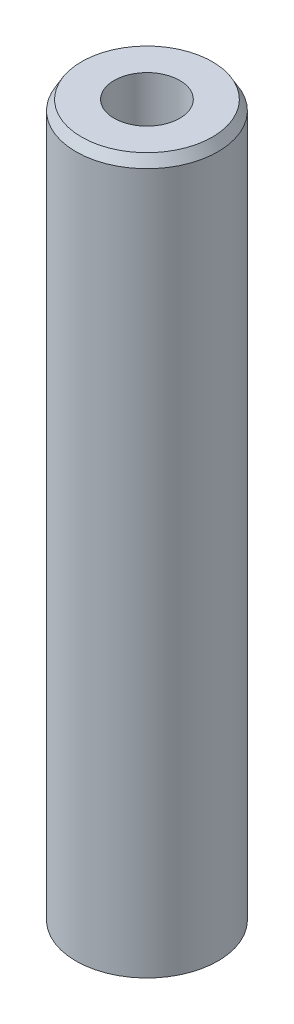
ISO-10303-21;
HEADER;
FILE_DESCRIPTION(('STEP AP214'),'2;1');
FILE_NAME('part.step','',(''),(''),'','','');
FILE_SCHEMA(('AUTOMOTIVE_DESIGN { 1 0 10303 214 1 1 1 1 }'));
ENDSEC;
DATA;
#1=APPLICATION_CONTEXT('core data for automotive mechanical design processes');
#2=APPLICATION_PROTOCOL_DEFINITION('international standard','automotive_design',2000,#1);
#3=PRODUCT_CONTEXT('',#1,'mechanical');
#4=PRODUCT('Part','Part','',(#3));
#5=PRODUCT_RELATED_PRODUCT_CATEGORY('part','',(#4));
#6=PRODUCT_DEFINITION_FORMATION('','',#4);
#7=PRODUCT_DEFINITION_CONTEXT('part definition',#1,'design');
#8=PRODUCT_DEFINITION('design','',#6,#7);
#9=PRODUCT_DEFINITION_SHAPE('','',#8);
#10=(LENGTH_UNIT() NAMED_UNIT(*) SI_UNIT(.MILLI.,.METRE.));
#11=(NAMED_UNIT(*) PLANE_ANGLE_UNIT() SI_UNIT($,.RADIAN.));
#12=(NAMED_UNIT(*) SI_UNIT($,.STERADIAN.) SOLID_ANGLE_UNIT());
#13=UNCERTAINTY_MEASURE_WITH_UNIT(LENGTH_MEASURE(1.E-05),#10,'distance_accuracy_value','');
#14=(GEOMETRIC_REPRESENTATION_CONTEXT(3) GLOBAL_UNCERTAINTY_ASSIGNED_CONTEXT((#13)) GLOBAL_UNIT_ASSIGNED_CONTEXT((#10,
#11,#12)) REPRESENTATION_CONTEXT('',''));
#15=CARTESIAN_POINT('',(0.,0.,0.));
#16=DIRECTION('',(0.,0.,1.));
#17=DIRECTION('',(1.,0.,0.));
#18=AXIS2_PLACEMENT_3D('',#15,#16,#17);
#19=CARTESIAN_POINT('',(0.,126.050752585523,0.));
#20=DIRECTION('',(0.,-1.,0.));
#21=DIRECTION('',(0.,0.,-1.));
#22=AXIS2_PLACEMENT_3D('',#19,#20,#21);
#23=CYLINDRICAL_SURFACE('',#22,12.5);
#24=CARTESIAN_POINT('',(0.,124.318361908282,0.));
#25=DIRECTION('',(0.,1.,0.));
#26=DIRECTION('',(0.,0.,1.));
#27=AXIS2_PLACEMENT_3D('',#24,#25,#26);
#28=CIRCLE('',#27,12.5);
#29=CARTESIAN_POINT('',(0.,124.318361908282,12.5));
#30=VERTEX_POINT('',#29);
#31=EDGE_CURVE('E50',#30,#30,#28,.F.);
#32=ORIENTED_EDGE('',*,*,#31,.T.);
#33=EDGE_LOOP('',(#32));
#34=FACE_BOUND('',#33,.T.);
#35=CARTESIAN_POINT('',(0.,1.00019622384667,0.));
#36=DIRECTION('',(0.,1.,0.));
#37=DIRECTION('',(0.,0.,1.));
#38=AXIS2_PLACEMENT_3D('',#35,#36,#37);
#39=CIRCLE('',#38,12.5);
#40=CARTESIAN_POINT('',(0.,1.00019622384667,12.5));
#41=VERTEX_POINT('',#40);
#42=EDGE_CURVE('E51',#41,#41,#39,.T.);
#43=ORIENTED_EDGE('',*,*,#42,.T.);
#44=EDGE_LOOP('',(#43));
#45=FACE_BOUND('',#44,.T.);
#46=ADVANCED_FACE('F39',(#34,#45),#23,.T.);
#47=CARTESIAN_POINT('',(0.,126.050752585523,0.));
#48=DIRECTION('',(0.,1.,0.));
#49=DIRECTION('',(0.,0.,1.));
#50=AXIS2_PLACEMENT_3D('',#47,#48,#49);
#51=PLANE('',#50);
#52=CARTESIAN_POINT('',(0.,126.050752585523,0.));
#53=DIRECTION('',(0.,1.,0.));
#54=DIRECTION('',(0.,0.,1.));
#55=AXIS2_PLACEMENT_3D('',#52,#53,#54);
#56=CIRCLE('',#55,11.4998037761534);
#57=CARTESIAN_POINT('',(0.,126.050752585523,11.4998037761534));
#58=VERTEX_POINT('',#57);
#59=EDGE_CURVE('E54',#58,#58,#56,.T.);
#60=ORIENTED_EDGE('',*,*,#59,.T.);
#61=EDGE_LOOP('',(#60));
#62=FACE_BOUND('',#61,.T.);
#63=CARTESIAN_POINT('',(0.,126.050752585523,0.));
#64=DIRECTION('',(0.,1.,0.));
#65=DIRECTION('',(0.,0.,1.));
#66=AXIS2_PLACEMENT_3D('',#63,#64,#65);
#67=CIRCLE('',#66,5.77568606063113);
#68=CARTESIAN_POINT('',(0.,126.050752585523,5.77568606063113));
#69=VERTEX_POINT('',#68);
#70=EDGE_CURVE('E58',#69,#69,#67,.T.);
#71=ORIENTED_EDGE('',*,*,#70,.F.);
#72=EDGE_LOOP('',(#71));
#73=FACE_BOUND('',#72,.T.);
#74=ADVANCED_FACE('F69',(#62,#73),#51,.T.);
#75=CARTESIAN_POINT('',(0.,0.,0.));
#76=DIRECTION('',(0.,1.,0.));
#77=DIRECTION('',(0.,0.,1.));
#78=AXIS2_PLACEMENT_3D('',#75,#76,#77);
#79=PLANE('',#78);
#80=CARTESIAN_POINT('',(0.,0.,0.));
#81=DIRECTION('',(0.,1.,0.));
#82=DIRECTION('',(0.,0.,1.));
#83=AXIS2_PLACEMENT_3D('',#80,#81,#82);
#84=CIRCLE('',#83,10.767609322759);
#85=CARTESIAN_POINT('',(0.,0.,10.767609322759));
#86=VERTEX_POINT('',#85);
#87=EDGE_CURVE('E10',#86,#86,#84,.F.);
#88=ORIENTED_EDGE('',*,*,#87,.T.);
#89=EDGE_LOOP('',(#88));
#90=FACE_BOUND('',#89,.T.);
#91=CARTESIAN_POINT('',(0.,0.,0.));
#92=DIRECTION('',(0.,1.,0.));
#93=DIRECTION('',(0.,0.,1.));
#94=AXIS2_PLACEMENT_3D('',#91,#92,#93);
#95=CIRCLE('',#94,5.77568606063113);
#96=CARTESIAN_POINT('',(0.,0.,5.77568606063113));
#97=VERTEX_POINT('',#96);
#98=EDGE_CURVE('E63',#97,#97,#95,.T.);
#99=ORIENTED_EDGE('',*,*,#98,.T.);
#100=EDGE_LOOP('',(#99));
#101=FACE_BOUND('',#100,.T.);
#102=ADVANCED_FACE('F75',(#90,#101),#79,.F.);
#103=CARTESIAN_POINT('',(0.,126.050752585523,0.));
#104=DIRECTION('',(0.,-1.,0.));
#105=DIRECTION('',(0.,0.,-1.));
#106=AXIS2_PLACEMENT_3D('',#103,#104,#105);
#107=CYLINDRICAL_SURFACE('',#106,5.77568606063113);
#108=ORIENTED_EDGE('',*,*,#70,.T.);
#109=EDGE_LOOP('',(#108));
#110=FACE_BOUND('',#109,.T.);
#111=ORIENTED_EDGE('',*,*,#98,.F.);
#112=EDGE_LOOP('',(#111));
#113=FACE_BOUND('',#112,.T.);
#114=ADVANCED_FACE('F70',(#110,#113),#107,.F.);
#115=CARTESIAN_POINT('',(0.,126.050752585523,0.));
#116=DIRECTION('',(0.,-1.,0.));
#117=DIRECTION('',(0.,0.,-1.));
#118=AXIS2_PLACEMENT_3D('',#115,#116,#117);
#119=CONICAL_SURFACE('',#118,11.4998037761534,0.523598775598299);
#120=ORIENTED_EDGE('',*,*,#31,.F.);
#121=EDGE_LOOP('',(#120));
#122=FACE_BOUND('',#121,.T.);
#123=ORIENTED_EDGE('',*,*,#59,.F.);
#124=EDGE_LOOP('',(#123));
#125=FACE_BOUND('',#124,.T.);
#126=ADVANCED_FACE('F81',(#122,#125),#119,.T.);
#127=CARTESIAN_POINT('',(0.,1.00019622384667,0.));
#128=DIRECTION('',(0.,1.,0.));
#129=DIRECTION('',(0.,0.,1.));
#130=AXIS2_PLACEMENT_3D('',#127,#128,#129);
#131=CONICAL_SURFACE('',#130,12.5,1.0471975511966);
#132=ORIENTED_EDGE('',*,*,#87,.F.);
#133=EDGE_LOOP('',(#132));
#134=FACE_BOUND('',#133,.T.);
#135=ORIENTED_EDGE('',*,*,#42,.F.);
#136=EDGE_LOOP('',(#135));
#137=FACE_BOUND('',#136,.T.);
#138=ADVANCED_FACE('F45',(#134,#137),#131,.T.);
#139=CLOSED_SHELL('',(#46,#74,#102,#114,#126,#138));
#140=MANIFOLD_SOLID_BREP('B2',#139);
#141=ADVANCED_BREP_SHAPE_REPRESENTATION('',(#18,#140),#14);
#142=SHAPE_DEFINITION_REPRESENTATION(#9,#141);
ENDSEC;
END-ISO-10303-21;
